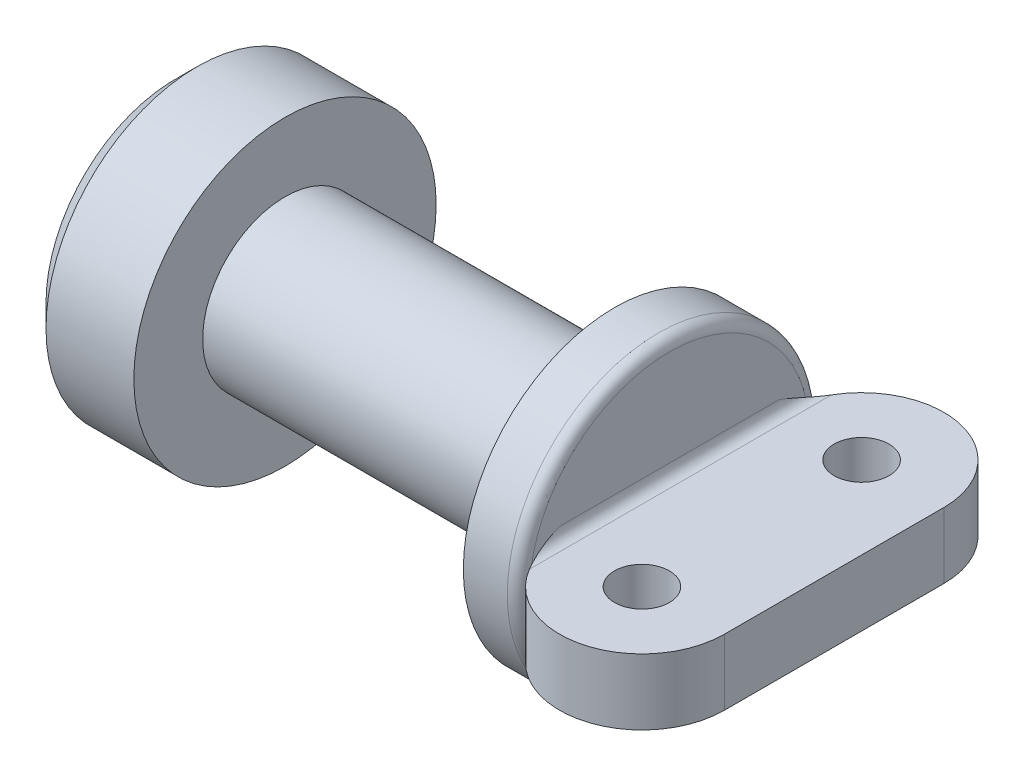
ISO-10303-21;
HEADER;
FILE_DESCRIPTION(('STEP AP214'),'2;1');
FILE_NAME('part.step','',(''),(''),'','','');
FILE_SCHEMA(('AUTOMOTIVE_DESIGN { 1 0 10303 214 1 1 1 1 }'));
ENDSEC;
DATA;
#1=APPLICATION_CONTEXT('core data for automotive mechanical design processes');
#2=APPLICATION_PROTOCOL_DEFINITION('international standard','automotive_design',2000,#1);
#3=PRODUCT_CONTEXT('',#1,'mechanical');
#4=PRODUCT('Part','Part','',(#3));
#5=PRODUCT_RELATED_PRODUCT_CATEGORY('part','',(#4));
#6=PRODUCT_DEFINITION_FORMATION('','',#4);
#7=PRODUCT_DEFINITION_CONTEXT('part definition',#1,'design');
#8=PRODUCT_DEFINITION('design','',#6,#7);
#9=PRODUCT_DEFINITION_SHAPE('','',#8);
#10=(LENGTH_UNIT() NAMED_UNIT(*) SI_UNIT(.MILLI.,.METRE.));
#11=(NAMED_UNIT(*) PLANE_ANGLE_UNIT() SI_UNIT($,.RADIAN.));
#12=(NAMED_UNIT(*) SI_UNIT($,.STERADIAN.) SOLID_ANGLE_UNIT());
#13=UNCERTAINTY_MEASURE_WITH_UNIT(LENGTH_MEASURE(1.E-05),#10,'distance_accuracy_value','');
#14=(GEOMETRIC_REPRESENTATION_CONTEXT(3) GLOBAL_UNCERTAINTY_ASSIGNED_CONTEXT((#13)) GLOBAL_UNIT_ASSIGNED_CONTEXT((#10,
#11,#12)) REPRESENTATION_CONTEXT('',''));
#15=CARTESIAN_POINT('',(0.,0.,0.));
#16=DIRECTION('',(0.,0.,1.));
#17=DIRECTION('',(1.,0.,0.));
#18=AXIS2_PLACEMENT_3D('',#15,#16,#17);
#19=CARTESIAN_POINT('',(3.,0.,0.));
#20=DIRECTION('',(-1.,0.,0.));
#21=DIRECTION('',(0.,0.,1.));
#22=AXIS2_PLACEMENT_3D('',#19,#20,#21);
#23=CYLINDRICAL_SURFACE('',#22,0.75);
#24=CARTESIAN_POINT('',(3.,0.,0.));
#25=DIRECTION('',(1.,0.,0.));
#26=DIRECTION('',(0.,0.,-1.));
#27=AXIS2_PLACEMENT_3D('',#24,#25,#26);
#28=CIRCLE('',#27,0.75);
#29=CARTESIAN_POINT('',(3.,0.,-0.75));
#30=VERTEX_POINT('',#29);
#31=EDGE_CURVE('E145',#30,#30,#28,.T.);
#32=ORIENTED_EDGE('',*,*,#31,.F.);
#33=EDGE_LOOP('',(#32));
#34=FACE_BOUND('',#33,.T.);
#35=CARTESIAN_POINT('',(0.,0.,0.));
#36=DIRECTION('',(1.,0.,0.));
#37=DIRECTION('',(0.,0.,-1.));
#38=AXIS2_PLACEMENT_3D('',#35,#36,#37);
#39=CIRCLE('',#38,0.75);
#40=CARTESIAN_POINT('',(0.,0.,-0.75));
#41=VERTEX_POINT('',#40);
#42=EDGE_CURVE('E144',#41,#41,#39,.T.);
#43=ORIENTED_EDGE('',*,*,#42,.T.);
#44=EDGE_LOOP('',(#43));
#45=FACE_BOUND('',#44,.T.);
#46=ADVANCED_FACE('F41',(#34,#45),#23,.T.);
#47=CARTESIAN_POINT('',(-1.,0.,0.));
#48=DIRECTION('',(1.,0.,0.));
#49=DIRECTION('',(0.,0.,-1.));
#50=AXIS2_PLACEMENT_3D('',#47,#48,#49);
#51=CYLINDRICAL_SURFACE('',#50,1.37619009260402);
#52=CARTESIAN_POINT('',(-0.799999999999999,0.,0.));
#53=DIRECTION('',(-1.,0.,0.));
#54=DIRECTION('',(0.,0.,1.));
#55=AXIS2_PLACEMENT_3D('',#52,#53,#54);
#56=CIRCLE('',#55,1.37619009260402);
#57=CARTESIAN_POINT('',(-0.799999999999999,0.,1.37619009260402));
#58=VERTEX_POINT('',#57);
#59=EDGE_CURVE('E156',#58,#58,#56,.F.);
#60=ORIENTED_EDGE('',*,*,#59,.T.);
#61=EDGE_LOOP('',(#60));
#62=FACE_BOUND('',#61,.T.);
#63=CARTESIAN_POINT('',(0.,0.,0.));
#64=DIRECTION('',(-1.,0.,0.));
#65=DIRECTION('',(0.,0.,1.));
#66=AXIS2_PLACEMENT_3D('',#63,#64,#65);
#67=CIRCLE('',#66,1.37619009260402);
#68=CARTESIAN_POINT('',(0.,0.,1.37619009260402));
#69=VERTEX_POINT('',#68);
#70=EDGE_CURVE('E140',#69,#69,#67,.T.);
#71=ORIENTED_EDGE('',*,*,#70,.T.);
#72=EDGE_LOOP('',(#71));
#73=FACE_BOUND('',#72,.T.);
#74=ADVANCED_FACE('F224',(#62,#73),#51,.T.);
#75=CARTESIAN_POINT('',(-1.,0.,0.));
#76=DIRECTION('',(-1.,0.,0.));
#77=DIRECTION('',(0.,0.,1.));
#78=AXIS2_PLACEMENT_3D('',#75,#76,#77);
#79=PLANE('',#78);
#80=CARTESIAN_POINT('',(-1.,0.,0.));
#81=DIRECTION('',(-1.,0.,0.));
#82=DIRECTION('',(0.,0.,1.));
#83=AXIS2_PLACEMENT_3D('',#80,#81,#82);
#84=CIRCLE('',#83,1.17619009260402);
#85=CARTESIAN_POINT('',(-1.,0.,1.17619009260402));
#86=VERTEX_POINT('',#85);
#87=EDGE_CURVE('E149',#86,#86,#84,.T.);
#88=ORIENTED_EDGE('',*,*,#87,.T.);
#89=EDGE_LOOP('',(#88));
#90=FACE_BOUND('',#89,.T.);
#91=ADVANCED_FACE('F229',(#90),#79,.T.);
#92=CARTESIAN_POINT('',(0.,0.,0.));
#93=DIRECTION('',(-1.,0.,0.));
#94=DIRECTION('',(0.,0.,1.));
#95=AXIS2_PLACEMENT_3D('',#92,#93,#94);
#96=PLANE('',#95);
#97=ORIENTED_EDGE('',*,*,#42,.F.);
#98=EDGE_LOOP('',(#97));
#99=FACE_BOUND('',#98,.T.);
#100=ORIENTED_EDGE('',*,*,#70,.F.);
#101=EDGE_LOOP('',(#100));
#102=FACE_BOUND('',#101,.T.);
#103=ADVANCED_FACE('F235',(#99,#102),#96,.F.);
#104=CARTESIAN_POINT('',(3.5,0.,0.));
#105=DIRECTION('',(-1.,0.,0.));
#106=DIRECTION('',(0.,0.,1.));
#107=AXIS2_PLACEMENT_3D('',#104,#105,#106);
#108=CYLINDRICAL_SURFACE('',#107,1.37619009260402);
#109=CARTESIAN_POINT('',(3.4,0.,0.));
#110=DIRECTION('',(1.,0.,0.));
#111=DIRECTION('',(0.,0.,-1.));
#112=AXIS2_PLACEMENT_3D('',#109,#110,#111);
#113=CIRCLE('',#112,1.37619009260402);
#114=CARTESIAN_POINT('',(3.4,0.,-1.37619009260402));
#115=VERTEX_POINT('',#114);
#116=EDGE_CURVE('E11',#115,#115,#113,.F.);
#117=ORIENTED_EDGE('',*,*,#116,.T.);
#118=EDGE_LOOP('',(#117));
#119=FACE_BOUND('',#118,.T.);
#120=CARTESIAN_POINT('',(3.,0.,0.));
#121=DIRECTION('',(1.,0.,0.));
#122=DIRECTION('',(0.,0.,-1.));
#123=AXIS2_PLACEMENT_3D('',#120,#121,#122);
#124=CIRCLE('',#123,1.37619009260402);
#125=CARTESIAN_POINT('',(3.,0.,-1.37619009260402));
#126=VERTEX_POINT('',#125);
#127=EDGE_CURVE('E132',#126,#126,#124,.T.);
#128=ORIENTED_EDGE('',*,*,#127,.T.);
#129=EDGE_LOOP('',(#128));
#130=FACE_BOUND('',#129,.T.);
#131=ADVANCED_FACE('F238',(#119,#130),#108,.T.);
#132=CARTESIAN_POINT('',(3.5,0.,0.));
#133=DIRECTION('',(1.,0.,0.));
#134=DIRECTION('',(0.,0.,-1.));
#135=AXIS2_PLACEMENT_3D('',#132,#133,#134);
#136=PLANE('',#135);
#137=CARTESIAN_POINT('',(3.5,0.,0.));
#138=DIRECTION('',(1.,0.,0.));
#139=DIRECTION('',(0.,0.,-1.));
#140=AXIS2_PLACEMENT_3D('',#137,#138,#139);
#141=CIRCLE('',#140,1.27619009260402);
#142=CARTESIAN_POINT('',(3.5,0.,-1.27619009260402));
#143=VERTEX_POINT('',#142);
#144=EDGE_CURVE('E50',#143,#143,#141,.T.);
#145=ORIENTED_EDGE('',*,*,#144,.T.);
#146=EDGE_LOOP('',(#145));
#147=FACE_BOUND('',#146,.T.);
#148=DIRECTION('',(0.,1.,0.));
#149=VECTOR('',#148,1.);
#150=CARTESIAN_POINT('',(3.5,0.300000000000001,-1.));
#151=LINE('',#150,#149);
#152=CARTESIAN_POINT('',(3.5,-0.4,-1.));
#153=VERTEX_POINT('',#152);
#154=CARTESIAN_POINT('',(3.5,0.400000000000001,-1.));
#155=VERTEX_POINT('',#154);
#156=EDGE_CURVE('E57',#153,#155,#151,.T.);
#157=ORIENTED_EDGE('',*,*,#156,.F.);
#158=DIRECTION('',(0.,0.,-1.));
#159=VECTOR('',#158,1.);
#160=CARTESIAN_POINT('',(3.5,-0.4,0.));
#161=LINE('',#160,#159);
#162=CARTESIAN_POINT('',(3.5,-0.4,1.));
#163=VERTEX_POINT('',#162);
#164=EDGE_CURVE('E438',#153,#163,#161,.F.);
#165=ORIENTED_EDGE('',*,*,#164,.T.);
#166=DIRECTION('',(0.,-1.,0.));
#167=VECTOR('',#166,1.);
#168=CARTESIAN_POINT('',(3.5,0.3,1.));
#169=LINE('',#168,#167);
#170=CARTESIAN_POINT('',(3.5,0.4,1.));
#171=VERTEX_POINT('',#170);
#172=EDGE_CURVE('E65',#171,#163,#169,.T.);
#173=ORIENTED_EDGE('',*,*,#172,.F.);
#174=DIRECTION('',(0.,0.,1.));
#175=VECTOR('',#174,1.);
#176=CARTESIAN_POINT('',(3.5,0.400000000000001,0.));
#177=LINE('',#176,#175);
#178=EDGE_CURVE('E164',#171,#155,#177,.F.);
#179=ORIENTED_EDGE('',*,*,#178,.T.);
#180=EDGE_LOOP('',(#157,#165,#173,#179));
#181=FACE_BOUND('',#180,.T.);
#182=ADVANCED_FACE('F216',(#147,#181),#136,.T.);
#183=CARTESIAN_POINT('',(3.,0.,0.));
#184=DIRECTION('',(1.,0.,0.));
#185=DIRECTION('',(0.,0.,-1.));
#186=AXIS2_PLACEMENT_3D('',#183,#184,#185);
#187=PLANE('',#186);
#188=ORIENTED_EDGE('',*,*,#31,.T.);
#189=EDGE_LOOP('',(#188));
#190=FACE_BOUND('',#189,.T.);
#191=ORIENTED_EDGE('',*,*,#127,.F.);
#192=EDGE_LOOP('',(#191));
#193=FACE_BOUND('',#192,.T.);
#194=ADVANCED_FACE('F246',(#190,#193),#187,.F.);
#195=CARTESIAN_POINT('',(5.,-0.3,1.));
#196=DIRECTION('',(0.,1.,0.));
#197=DIRECTION('',(0.,0.,1.));
#198=AXIS2_PLACEMENT_3D('',#195,#196,#197);
#199=PLANE('',#198);
#200=CARTESIAN_POINT('',(4.25,-0.3,1.));
#201=DIRECTION('',(0.,1.,0.));
#202=DIRECTION('',(0.,0.,1.));
#203=AXIS2_PLACEMENT_3D('',#200,#201,#202);
#204=CIRCLE('',#203,0.25);
#205=CARTESIAN_POINT('',(4.25,-0.3,1.25));
#206=VERTEX_POINT('',#205);
#207=EDGE_CURVE('E414',#206,#206,#204,.F.);
#208=ORIENTED_EDGE('',*,*,#207,.F.);
#209=EDGE_LOOP('',(#208));
#210=FACE_BOUND('',#209,.T.);
#211=CARTESIAN_POINT('',(4.25,-0.3,1.));
#212=DIRECTION('',(0.,1.,0.));
#213=DIRECTION('',(0.,0.,1.));
#214=AXIS2_PLACEMENT_3D('',#211,#212,#213);
#215=CIRCLE('',#214,0.75);
#216=CARTESIAN_POINT('',(5.,-0.3,1.));
#217=VERTEX_POINT('',#216);
#218=CARTESIAN_POINT('',(3.6,-0.3,1.37416573867739));
#219=VERTEX_POINT('',#218);
#220=EDGE_CURVE('E119',#217,#219,#215,.F.);
#221=ORIENTED_EDGE('',*,*,#220,.T.);
#222=DIRECTION('',(0.,0.,-1.));
#223=VECTOR('',#222,1.);
#224=CARTESIAN_POINT('',(3.6,-0.3,1.));
#225=LINE('',#224,#223);
#226=CARTESIAN_POINT('',(3.6,-0.299999999999998,-1.37416573867739));
#227=VERTEX_POINT('',#226);
#228=EDGE_CURVE('E117',#219,#227,#225,.T.);
#229=ORIENTED_EDGE('',*,*,#228,.T.);
#230=CARTESIAN_POINT('',(4.25,-0.299999999999998,-1.));
#231=DIRECTION('',(0.,1.,0.));
#232=DIRECTION('',(0.,0.,1.));
#233=AXIS2_PLACEMENT_3D('',#230,#231,#232);
#234=CIRCLE('',#233,0.75);
#235=CARTESIAN_POINT('',(5.,-0.299999999999998,-1.));
#236=VERTEX_POINT('',#235);
#237=EDGE_CURVE('E98',#236,#227,#234,.T.);
#238=ORIENTED_EDGE('',*,*,#237,.F.);
#239=DIRECTION('',(0.,0.,-1.));
#240=VECTOR('',#239,1.);
#241=CARTESIAN_POINT('',(5.,-0.3,1.));
#242=LINE('',#241,#240);
#243=EDGE_CURVE('E107',#217,#236,#242,.T.);
#244=ORIENTED_EDGE('',*,*,#243,.F.);
#245=EDGE_LOOP('',(#221,#229,#238,#244));
#246=FACE_BOUND('',#245,.T.);
#247=CARTESIAN_POINT('',(4.25,-0.299999999999998,-1.));
#248=DIRECTION('',(0.,1.,0.));
#249=DIRECTION('',(0.,0.,1.));
#250=AXIS2_PLACEMENT_3D('',#247,#248,#249);
#251=CIRCLE('',#250,0.25);
#252=CARTESIAN_POINT('',(4.25,-0.299999999999999,-0.75));
#253=VERTEX_POINT('',#252);
#254=EDGE_CURVE('E120',#253,#253,#251,.T.);
#255=ORIENTED_EDGE('',*,*,#254,.T.);
#256=EDGE_LOOP('',(#255));
#257=FACE_BOUND('',#256,.T.);
#258=ADVANCED_FACE('F113',(#210,#246,#257),#199,.F.);
#259=CARTESIAN_POINT('',(5.,0.3,1.));
#260=DIRECTION('',(0.,-1.,0.));
#261=DIRECTION('',(0.,0.,-1.));
#262=AXIS2_PLACEMENT_3D('',#259,#260,#261);
#263=PLANE('',#262);
#264=CARTESIAN_POINT('',(4.25,0.3,1.));
#265=DIRECTION('',(0.,1.,0.));
#266=DIRECTION('',(0.,0.,1.));
#267=AXIS2_PLACEMENT_3D('',#264,#265,#266);
#268=CIRCLE('',#267,0.25);
#269=CARTESIAN_POINT('',(4.25,0.3,1.25));
#270=VERTEX_POINT('',#269);
#271=EDGE_CURVE('E425',#270,#270,#268,.F.);
#272=ORIENTED_EDGE('',*,*,#271,.T.);
#273=EDGE_LOOP('',(#272));
#274=FACE_BOUND('',#273,.T.);
#275=CARTESIAN_POINT('',(4.25,0.300000000000001,-1.));
#276=DIRECTION('',(0.,1.,0.));
#277=DIRECTION('',(0.,0.,1.));
#278=AXIS2_PLACEMENT_3D('',#275,#276,#277);
#279=CIRCLE('',#278,0.25);
#280=CARTESIAN_POINT('',(4.25,0.300000000000001,-0.749999999999999));
#281=VERTEX_POINT('',#280);
#282=EDGE_CURVE('E419',#281,#281,#279,.T.);
#283=ORIENTED_EDGE('',*,*,#282,.F.);
#284=EDGE_LOOP('',(#283));
#285=FACE_BOUND('',#284,.T.);
#286=CARTESIAN_POINT('',(4.25,0.300000000000001,-1.));
#287=DIRECTION('',(0.,1.,0.));
#288=DIRECTION('',(0.,0.,1.));
#289=AXIS2_PLACEMENT_3D('',#286,#287,#288);
#290=CIRCLE('',#289,0.75);
#291=CARTESIAN_POINT('',(5.,0.300000000000001,-1.));
#292=VERTEX_POINT('',#291);
#293=CARTESIAN_POINT('',(3.6,0.300000000000002,-1.37416573867739));
#294=VERTEX_POINT('',#293);
#295=EDGE_CURVE('E100',#292,#294,#290,.T.);
#296=ORIENTED_EDGE('',*,*,#295,.T.);
#297=DIRECTION('',(0.,0.,1.));
#298=VECTOR('',#297,1.);
#299=CARTESIAN_POINT('',(3.6,0.3,1.));
#300=LINE('',#299,#298);
#301=CARTESIAN_POINT('',(3.6,0.3,1.37416573867739));
#302=VERTEX_POINT('',#301);
#303=EDGE_CURVE('E160',#294,#302,#300,.T.);
#304=ORIENTED_EDGE('',*,*,#303,.T.);
#305=CARTESIAN_POINT('',(4.25,0.3,1.));
#306=DIRECTION('',(0.,1.,0.));
#307=DIRECTION('',(0.,0.,1.));
#308=AXIS2_PLACEMENT_3D('',#305,#306,#307);
#309=CIRCLE('',#308,0.75);
#310=CARTESIAN_POINT('',(5.,0.3,1.));
#311=VERTEX_POINT('',#310);
#312=EDGE_CURVE('E410',#311,#302,#309,.F.);
#313=ORIENTED_EDGE('',*,*,#312,.F.);
#314=DIRECTION('',(0.,0.,1.));
#315=VECTOR('',#314,1.);
#316=CARTESIAN_POINT('',(5.,0.3,1.));
#317=LINE('',#316,#315);
#318=EDGE_CURVE('E106',#292,#311,#317,.T.);
#319=ORIENTED_EDGE('',*,*,#318,.F.);
#320=EDGE_LOOP('',(#296,#304,#313,#319));
#321=FACE_BOUND('',#320,.T.);
#322=ADVANCED_FACE('F254',(#274,#285,#321),#263,.F.);
#323=CARTESIAN_POINT('',(5.,0.,0.));
#324=DIRECTION('',(1.,0.,0.));
#325=DIRECTION('',(0.,0.,-1.));
#326=AXIS2_PLACEMENT_3D('',#323,#324,#325);
#327=PLANE('',#326);
#328=DIRECTION('',(0.,-1.,0.));
#329=VECTOR('',#328,1.);
#330=CARTESIAN_POINT('',(5.,0.3,1.));
#331=LINE('',#330,#329);
#332=EDGE_CURVE('E123',#311,#217,#331,.T.);
#333=ORIENTED_EDGE('',*,*,#332,.T.);
#334=ORIENTED_EDGE('',*,*,#243,.T.);
#335=DIRECTION('',(0.,1.,0.));
#336=VECTOR('',#335,1.);
#337=CARTESIAN_POINT('',(5.,0.300000000000001,-1.));
#338=LINE('',#337,#336);
#339=EDGE_CURVE('E95',#236,#292,#338,.T.);
#340=ORIENTED_EDGE('',*,*,#339,.T.);
#341=ORIENTED_EDGE('',*,*,#318,.T.);
#342=EDGE_LOOP('',(#333,#334,#340,#341));
#343=FACE_BOUND('',#342,.T.);
#344=ADVANCED_FACE('F122',(#343),#327,.T.);
#345=CARTESIAN_POINT('',(4.25,-0.299999999999998,-1.));
#346=DIRECTION('',(0.,1.,0.));
#347=DIRECTION('',(0.,0.,1.));
#348=AXIS2_PLACEMENT_3D('',#345,#346,#347);
#349=CYLINDRICAL_SURFACE('',#348,0.75);
#350=ORIENTED_EDGE('',*,*,#295,.F.);
#351=ORIENTED_EDGE('',*,*,#339,.F.);
#352=ORIENTED_EDGE('',*,*,#237,.T.);
#353=CARTESIAN_POINT('',(3.6,-0.3,-1.37416573867739));
#354=CARTESIAN_POINT('',(3.59374693556029,-0.300011573706365,-1.36330565341647));
#355=CARTESIAN_POINT('',(3.58777860717995,-0.30058464718101,-1.35230522658815));
#356=CARTESIAN_POINT('',(3.57644157912426,-0.302641870514587,-1.3301112829731));
#357=CARTESIAN_POINT('',(3.57107156301259,-0.304123971559862,-1.31891825526408));
#358=CARTESIAN_POINT('',(3.5559142393425,-0.309603687295398,-1.28521897965746));
#359=CARTESIAN_POINT('',(3.54701732168187,-0.314639029278404,-1.26248355101029));
#360=CARTESIAN_POINT('',(3.52631422978915,-0.330442123639796,-1.2010795038134));
#361=CARTESIAN_POINT('',(3.51665518954299,-0.34277817154211,-1.16210793394652));
#362=CARTESIAN_POINT('',(3.50363748105907,-0.369442138869541,-1.08379087101348));
#363=CARTESIAN_POINT('',(3.50028686382517,-0.383772578598485,-1.04444496444738));
#364=CARTESIAN_POINT('',(3.50000589857819,-0.398747585559976,-1.00342989388846));
#365=CARTESIAN_POINT('',(3.50000001834683,-0.399373815661799,-1.00171489455534));
#366=CARTESIAN_POINT('',(3.5,-0.4,-1.));
#367=B_SPLINE_CURVE_WITH_KNOTS('',3,(#353,#354,#355,#356,#357,#358,#359,#360,#361,#362,#363,
#364,#365,#366),.UNSPECIFIED.,.F.,.F.,(4,2,2,2,2,2,4),(0.,0.0375486515411696,0.0750129833915668,
0.149569147360319,0.274916630357741,0.400423977523451,0.405901231534915),.UNSPECIFIED.);
#368=EDGE_CURVE('E199',#227,#153,#367,.T.);
#369=ORIENTED_EDGE('',*,*,#368,.T.);
#370=ORIENTED_EDGE('',*,*,#156,.T.);
#371=CARTESIAN_POINT('',(3.6,0.300000000000002,-1.37416573867739));
#372=CARTESIAN_POINT('',(3.59374693556029,0.300011573706367,-1.36330565341647));
#373=CARTESIAN_POINT('',(3.58777860717995,0.300584647181012,-1.35230522658815));
#374=CARTESIAN_POINT('',(3.57644157912426,0.302641870514589,-1.3301112829731));
#375=CARTESIAN_POINT('',(3.57107156301259,0.304123971559864,-1.31891825526408));
#376=CARTESIAN_POINT('',(3.5559142393425,0.3096036872954,-1.28521897965746));
#377=CARTESIAN_POINT('',(3.54701732168187,0.314639029278405,-1.26248355101029));
#378=CARTESIAN_POINT('',(3.52631422978915,0.330442123639798,-1.2010795038134));
#379=CARTESIAN_POINT('',(3.51665518954299,0.342778171542113,-1.16210793394652));
#380=CARTESIAN_POINT('',(3.50363748105907,0.369442138869542,-1.08379087101348));
#381=CARTESIAN_POINT('',(3.50028686382517,0.383772578598484,-1.04444496444738));
#382=CARTESIAN_POINT('',(3.50000589857819,0.398747585559978,-1.00342989388846));
#383=CARTESIAN_POINT('',(3.50000001834683,0.399373815661801,-1.00171489455534));
#384=CARTESIAN_POINT('',(3.5,0.400000000000001,-1.));
#385=B_SPLINE_CURVE_WITH_KNOTS('',3,(#371,#372,#373,#374,#375,#376,#377,#378,#379,#380,#381,
#382,#383,#384),.UNSPECIFIED.,.F.,.F.,(4,2,2,2,2,2,4),(0.,0.0375486515411692,0.0750129833915666,
0.149569147360319,0.274916630357741,0.400423977523451,0.405901231534915),.UNSPECIFIED.);
#386=EDGE_CURVE('E176',#155,#294,#385,.F.);
#387=ORIENTED_EDGE('',*,*,#386,.T.);
#388=EDGE_LOOP('',(#350,#351,#352,#369,#370,#387));
#389=FACE_BOUND('',#388,.T.);
#390=ADVANCED_FACE('F97',(#389),#349,.T.);
#391=CARTESIAN_POINT('',(4.25,-0.299999999999998,-1.));
#392=DIRECTION('',(0.,1.,0.));
#393=DIRECTION('',(0.,0.,1.));
#394=AXIS2_PLACEMENT_3D('',#391,#392,#393);
#395=CYLINDRICAL_SURFACE('',#394,0.25);
#396=ORIENTED_EDGE('',*,*,#282,.T.);
#397=EDGE_LOOP('',(#396));
#398=FACE_BOUND('',#397,.T.);
#399=ORIENTED_EDGE('',*,*,#254,.F.);
#400=EDGE_LOOP('',(#399));
#401=FACE_BOUND('',#400,.T.);
#402=ADVANCED_FACE('F264',(#398,#401),#395,.F.);
#403=CARTESIAN_POINT('',(4.25,-0.3,1.));
#404=DIRECTION('',(0.,1.,0.));
#405=DIRECTION('',(0.,0.,1.));
#406=AXIS2_PLACEMENT_3D('',#403,#404,#405);
#407=CYLINDRICAL_SURFACE('',#406,0.25);
#408=ORIENTED_EDGE('',*,*,#207,.T.);
#409=EDGE_LOOP('',(#408));
#410=FACE_BOUND('',#409,.T.);
#411=ORIENTED_EDGE('',*,*,#271,.F.);
#412=EDGE_LOOP('',(#411));
#413=FACE_BOUND('',#412,.T.);
#414=ADVANCED_FACE('F261',(#410,#413),#407,.F.);
#415=CARTESIAN_POINT('',(4.25,-0.3,1.));
#416=DIRECTION('',(0.,1.,0.));
#417=DIRECTION('',(0.,0.,1.));
#418=AXIS2_PLACEMENT_3D('',#415,#416,#417);
#419=CYLINDRICAL_SURFACE('',#418,0.75);
#420=ORIENTED_EDGE('',*,*,#312,.T.);
#421=CARTESIAN_POINT('',(3.6,0.3,1.37416573867739));
#422=CARTESIAN_POINT('',(3.59374693556029,0.300011573706365,1.36330565341647));
#423=CARTESIAN_POINT('',(3.58777860717995,0.30058464718101,1.35230522658815));
#424=CARTESIAN_POINT('',(3.57644157912426,0.302641870514587,1.3301112829731));
#425=CARTESIAN_POINT('',(3.57107156301259,0.304123971559862,1.31891825526408));
#426=CARTESIAN_POINT('',(3.5559142393425,0.309603687295398,1.28521897965746));
#427=CARTESIAN_POINT('',(3.54701732168187,0.314639029278403,1.26248355101029));
#428=CARTESIAN_POINT('',(3.52631422978915,0.330442123639796,1.20107950381341));
#429=CARTESIAN_POINT('',(3.51665518954299,0.342778171542111,1.16210793394652));
#430=CARTESIAN_POINT('',(3.50363748105907,0.36944213886954,1.08379087101348));
#431=CARTESIAN_POINT('',(3.50028686382517,0.383772578598481,1.04444496444738));
#432=CARTESIAN_POINT('',(3.50000589857819,0.398747585559976,1.00342989388846));
#433=CARTESIAN_POINT('',(3.50000001834683,0.399373815661799,1.00171489455534));
#434=CARTESIAN_POINT('',(3.5,0.4,1.));
#435=B_SPLINE_CURVE_WITH_KNOTS('',3,(#421,#422,#423,#424,#425,#426,#427,#428,#429,#430,#431,
#432,#433,#434),.UNSPECIFIED.,.F.,.F.,(4,2,2,2,2,2,4),(0.,0.0375486515411694,0.0750129833915666,
0.149569147360319,0.274916630357742,0.400423977523452,0.405901231534915),.UNSPECIFIED.);
#436=EDGE_CURVE('E167',#302,#171,#435,.T.);
#437=ORIENTED_EDGE('',*,*,#436,.T.);
#438=ORIENTED_EDGE('',*,*,#172,.T.);
#439=CARTESIAN_POINT('',(3.6,-0.3,1.37416573867739));
#440=CARTESIAN_POINT('',(3.59374693556029,-0.300011573706365,1.36330565341647));
#441=CARTESIAN_POINT('',(3.58777860717995,-0.30058464718101,1.35230522658815));
#442=CARTESIAN_POINT('',(3.57644157912426,-0.302641870514587,1.3301112829731));
#443=CARTESIAN_POINT('',(3.57107156301259,-0.304123971559862,1.31891825526408));
#444=CARTESIAN_POINT('',(3.5559142393425,-0.309603687295398,1.28521897965746));
#445=CARTESIAN_POINT('',(3.54701732168187,-0.314639029278404,1.26248355101029));
#446=CARTESIAN_POINT('',(3.52631422978915,-0.330442123639796,1.2010795038134));
#447=CARTESIAN_POINT('',(3.51665518954299,-0.342778171542111,1.16210793394652));
#448=CARTESIAN_POINT('',(3.50363748105907,-0.36944213886954,1.08379087101348));
#449=CARTESIAN_POINT('',(3.50028686382517,-0.383772578598483,1.04444496444738));
#450=CARTESIAN_POINT('',(3.50000589857819,-0.398747585559976,1.00342989388846));
#451=CARTESIAN_POINT('',(3.50000001834683,-0.399373815661799,1.00171489455534));
#452=CARTESIAN_POINT('',(3.5,-0.4,1.));
#453=B_SPLINE_CURVE_WITH_KNOTS('',3,(#439,#440,#441,#442,#443,#444,#445,#446,#447,#448,#449,
#450,#451,#452),.UNSPECIFIED.,.F.,.F.,(4,2,2,2,2,2,4),(0.,0.0375486515411694,0.0750129833915666,
0.149569147360319,0.274916630357741,0.400423977523451,0.405901231534915),.UNSPECIFIED.);
#454=EDGE_CURVE('E206',#163,#219,#453,.F.);
#455=ORIENTED_EDGE('',*,*,#454,.T.);
#456=ORIENTED_EDGE('',*,*,#220,.F.);
#457=ORIENTED_EDGE('',*,*,#332,.F.);
#458=EDGE_LOOP('',(#420,#437,#438,#455,#456,#457));
#459=FACE_BOUND('',#458,.T.);
#460=ADVANCED_FACE('F183',(#459),#419,.T.);
#461=CARTESIAN_POINT('',(-1.,0.,0.));
#462=DIRECTION('',(1.,0.,0.));
#463=DIRECTION('',(0.,0.,-1.));
#464=AXIS2_PLACEMENT_3D('',#461,#462,#463);
#465=CONICAL_SURFACE('',#464,1.17619009260402,0.785398163397446);
#466=ORIENTED_EDGE('',*,*,#59,.F.);
#467=EDGE_LOOP('',(#466));
#468=FACE_BOUND('',#467,.T.);
#469=ORIENTED_EDGE('',*,*,#87,.F.);
#470=EDGE_LOOP('',(#469));
#471=FACE_BOUND('',#470,.T.);
#472=ADVANCED_FACE('F190',(#468,#471),#465,.T.);
#473=CARTESIAN_POINT('',(3.6,0.4,1.));
#474=DIRECTION('',(0.,0.,1.));
#475=DIRECTION('',(0.,-1.,0.));
#476=AXIS2_PLACEMENT_3D('',#473,#474,#475);
#477=CYLINDRICAL_SURFACE('',#476,0.1);
#478=ORIENTED_EDGE('',*,*,#386,.F.);
#479=ORIENTED_EDGE('',*,*,#178,.F.);
#480=ORIENTED_EDGE('',*,*,#436,.F.);
#481=ORIENTED_EDGE('',*,*,#303,.F.);
#482=EDGE_LOOP('',(#478,#479,#480,#481));
#483=FACE_BOUND('',#482,.T.);
#484=ADVANCED_FACE('F185',(#483),#477,.F.);
#485=CARTESIAN_POINT('',(3.6,-0.4,1.));
#486=DIRECTION('',(0.,0.,-1.));
#487=DIRECTION('',(-1.,0.,0.));
#488=AXIS2_PLACEMENT_3D('',#485,#486,#487);
#489=CYLINDRICAL_SURFACE('',#488,0.1);
#490=ORIENTED_EDGE('',*,*,#454,.F.);
#491=ORIENTED_EDGE('',*,*,#164,.F.);
#492=ORIENTED_EDGE('',*,*,#368,.F.);
#493=ORIENTED_EDGE('',*,*,#228,.F.);
#494=EDGE_LOOP('',(#490,#491,#492,#493));
#495=FACE_BOUND('',#494,.T.);
#496=ADVANCED_FACE('F189',(#495),#489,.F.);
#497=CARTESIAN_POINT('',(3.4,0.,0.));
#498=DIRECTION('',(1.,0.,0.));
#499=DIRECTION('',(0.,0.,-1.));
#500=AXIS2_PLACEMENT_3D('',#497,#498,#499);
#501=TOROIDAL_SURFACE('',#500,1.27619009260402,0.1);
#502=ORIENTED_EDGE('',*,*,#116,.F.);
#503=EDGE_LOOP('',(#502));
#504=FACE_BOUND('',#503,.T.);
#505=ORIENTED_EDGE('',*,*,#144,.F.);
#506=EDGE_LOOP('',(#505));
#507=FACE_BOUND('',#506,.T.);
#508=ADVANCED_FACE('F43',(#504,#507),#501,.T.);
#509=CLOSED_SHELL('',(#46,#74,#91,#103,#131,#182,#194,#258,#322,#344,#390,#402,#414,#460,#472,
#484,#496,#508));
#510=MANIFOLD_SOLID_BREP('B2',#509);
#511=ADVANCED_BREP_SHAPE_REPRESENTATION('',(#18,#510),#14);
#512=SHAPE_DEFINITION_REPRESENTATION(#9,#511);
ENDSEC;
END-ISO-10303-21;
